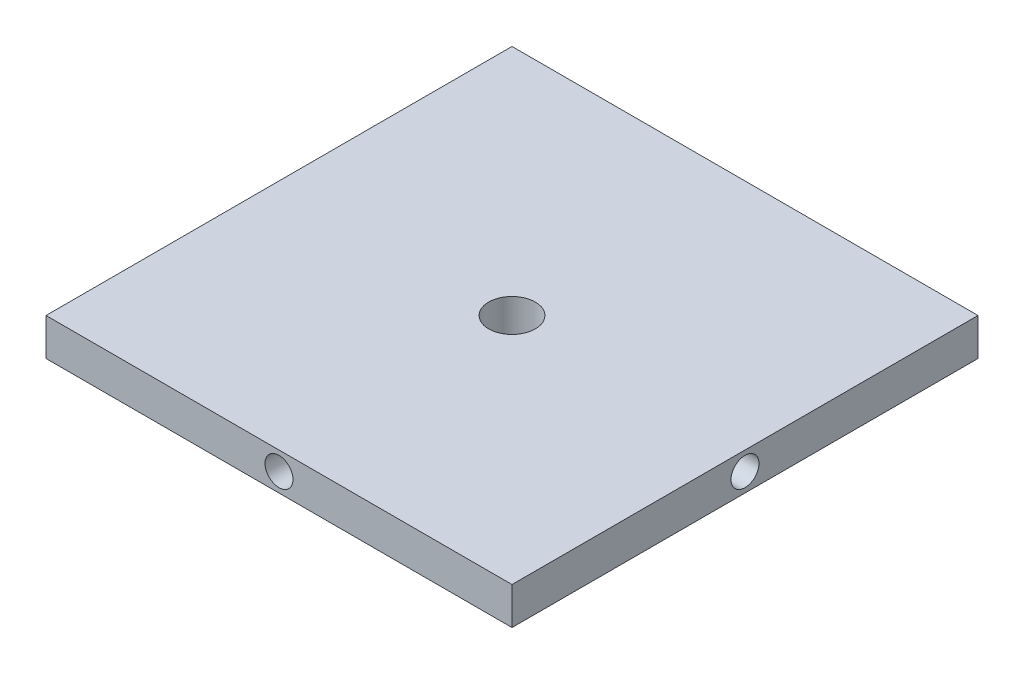
ISO-10303-21;
HEADER;
FILE_DESCRIPTION(('STEP AP214'),'2;1');
FILE_NAME('part.step','',(''),(''),'','','');
FILE_SCHEMA(('AUTOMOTIVE_DESIGN { 1 0 10303 214 1 1 1 1 }'));
ENDSEC;
DATA;
#1=APPLICATION_CONTEXT('core data for automotive mechanical design processes');
#2=APPLICATION_PROTOCOL_DEFINITION('international standard','automotive_design',2000,#1);
#3=PRODUCT_CONTEXT('',#1,'mechanical');
#4=PRODUCT('Part','Part','',(#3));
#5=PRODUCT_RELATED_PRODUCT_CATEGORY('part','',(#4));
#6=PRODUCT_DEFINITION_FORMATION('','',#4);
#7=PRODUCT_DEFINITION_CONTEXT('part definition',#1,'design');
#8=PRODUCT_DEFINITION('design','',#6,#7);
#9=PRODUCT_DEFINITION_SHAPE('','',#8);
#10=(LENGTH_UNIT() NAMED_UNIT(*) SI_UNIT(.MILLI.,.METRE.));
#11=(NAMED_UNIT(*) PLANE_ANGLE_UNIT() SI_UNIT($,.RADIAN.));
#12=(NAMED_UNIT(*) SI_UNIT($,.STERADIAN.) SOLID_ANGLE_UNIT());
#13=UNCERTAINTY_MEASURE_WITH_UNIT(LENGTH_MEASURE(1.E-05),#10,'distance_accuracy_value','');
#14=(GEOMETRIC_REPRESENTATION_CONTEXT(3) GLOBAL_UNCERTAINTY_ASSIGNED_CONTEXT((#13)) GLOBAL_UNIT_ASSIGNED_CONTEXT((#10,
#11,#12)) REPRESENTATION_CONTEXT('',''));
#15=CARTESIAN_POINT('',(0.,0.,0.));
#16=DIRECTION('',(0.,0.,1.));
#17=DIRECTION('',(1.,0.,0.));
#18=AXIS2_PLACEMENT_3D('',#15,#16,#17);
#19=CARTESIAN_POINT('',(0.,25.4,0.));
#20=DIRECTION('',(0.,-1.,0.));
#21=DIRECTION('',(0.,0.,-1.));
#22=AXIS2_PLACEMENT_3D('',#19,#20,#21);
#23=PLANE('',#22);
#24=DIRECTION('',(0.,0.,-1.));
#25=VECTOR('',#24,1.);
#26=CARTESIAN_POINT('',(158.75,25.4,158.75));
#27=LINE('',#26,#25);
#28=CARTESIAN_POINT('',(158.75,25.4,158.75));
#29=VERTEX_POINT('',#28);
#30=CARTESIAN_POINT('',(158.75,25.4,-158.75));
#31=VERTEX_POINT('',#30);
#32=EDGE_CURVE('E116',#29,#31,#27,.T.);
#33=ORIENTED_EDGE('',*,*,#32,.T.);
#34=DIRECTION('',(-1.,0.,0.));
#35=VECTOR('',#34,1.);
#36=CARTESIAN_POINT('',(-158.75,25.4,-158.75));
#37=LINE('',#36,#35);
#38=CARTESIAN_POINT('',(-158.75,25.4,-158.75));
#39=VERTEX_POINT('',#38);
#40=EDGE_CURVE('E81',#31,#39,#37,.T.);
#41=ORIENTED_EDGE('',*,*,#40,.T.);
#42=DIRECTION('',(0.,0.,1.));
#43=VECTOR('',#42,1.);
#44=CARTESIAN_POINT('',(-158.75,25.4,158.75));
#45=LINE('',#44,#43);
#46=CARTESIAN_POINT('',(-158.75,25.4,158.75));
#47=VERTEX_POINT('',#46);
#48=EDGE_CURVE('E119',#39,#47,#45,.T.);
#49=ORIENTED_EDGE('',*,*,#48,.T.);
#50=DIRECTION('',(1.,0.,0.));
#51=VECTOR('',#50,1.);
#52=CARTESIAN_POINT('',(-158.75,25.4,158.75));
#53=LINE('',#52,#51);
#54=EDGE_CURVE('E50',#47,#29,#53,.T.);
#55=ORIENTED_EDGE('',*,*,#54,.T.);
#56=EDGE_LOOP('',(#33,#41,#49,#55));
#57=FACE_BOUND('',#56,.T.);
#58=CARTESIAN_POINT('',(0.,25.4,0.));
#59=DIRECTION('',(0.,1.,0.));
#60=DIRECTION('',(0.,0.,1.));
#61=AXIS2_PLACEMENT_3D('',#58,#59,#60);
#62=CIRCLE('',#61,15.875);
#63=CARTESIAN_POINT('',(0.,25.4,15.875));
#64=VERTEX_POINT('',#63);
#65=EDGE_CURVE('E110',#64,#64,#62,.T.);
#66=ORIENTED_EDGE('',*,*,#65,.F.);
#67=EDGE_LOOP('',(#66));
#68=FACE_BOUND('',#67,.T.);
#69=ADVANCED_FACE('F33',(#57,#68),#23,.F.);
#70=CARTESIAN_POINT('',(0.,0.,0.));
#71=DIRECTION('',(0.,-1.,0.));
#72=DIRECTION('',(0.,0.,-1.));
#73=AXIS2_PLACEMENT_3D('',#70,#71,#72);
#74=PLANE('',#73);
#75=DIRECTION('',(0.,0.,-1.));
#76=VECTOR('',#75,1.);
#77=CARTESIAN_POINT('',(158.75,0.,158.75));
#78=LINE('',#77,#76);
#79=CARTESIAN_POINT('',(158.75,0.,158.75));
#80=VERTEX_POINT('',#79);
#81=CARTESIAN_POINT('',(158.75,0.,-158.75));
#82=VERTEX_POINT('',#81);
#83=EDGE_CURVE('E113',#80,#82,#78,.T.);
#84=ORIENTED_EDGE('',*,*,#83,.F.);
#85=DIRECTION('',(1.,0.,0.));
#86=VECTOR('',#85,1.);
#87=CARTESIAN_POINT('',(-158.75,0.,158.75));
#88=LINE('',#87,#86);
#89=CARTESIAN_POINT('',(-158.75,0.,158.75));
#90=VERTEX_POINT('',#89);
#91=EDGE_CURVE('E74',#90,#80,#88,.T.);
#92=ORIENTED_EDGE('',*,*,#91,.F.);
#93=DIRECTION('',(0.,0.,1.));
#94=VECTOR('',#93,1.);
#95=CARTESIAN_POINT('',(-158.75,0.,158.75));
#96=LINE('',#95,#94);
#97=CARTESIAN_POINT('',(-158.75,0.,-158.75));
#98=VERTEX_POINT('',#97);
#99=EDGE_CURVE('E68',#98,#90,#96,.T.);
#100=ORIENTED_EDGE('',*,*,#99,.F.);
#101=DIRECTION('',(-1.,0.,0.));
#102=VECTOR('',#101,1.);
#103=CARTESIAN_POINT('',(-158.75,0.,-158.75));
#104=LINE('',#103,#102);
#105=EDGE_CURVE('E125',#82,#98,#104,.T.);
#106=ORIENTED_EDGE('',*,*,#105,.F.);
#107=EDGE_LOOP('',(#84,#92,#100,#106));
#108=FACE_BOUND('',#107,.T.);
#109=CARTESIAN_POINT('',(0.,0.,0.));
#110=DIRECTION('',(0.,1.,0.));
#111=DIRECTION('',(0.,0.,1.));
#112=AXIS2_PLACEMENT_3D('',#109,#110,#111);
#113=CIRCLE('',#112,15.875);
#114=CARTESIAN_POINT('',(0.,0.,15.875));
#115=VERTEX_POINT('',#114);
#116=EDGE_CURVE('E109',#115,#115,#113,.T.);
#117=ORIENTED_EDGE('',*,*,#116,.T.);
#118=EDGE_LOOP('',(#117));
#119=FACE_BOUND('',#118,.T.);
#120=ADVANCED_FACE('F135',(#108,#119),#74,.T.);
#121=CARTESIAN_POINT('',(158.75,25.4,158.75));
#122=DIRECTION('',(-1.,0.,0.));
#123=DIRECTION('',(0.,0.,1.));
#124=AXIS2_PLACEMENT_3D('',#121,#122,#123);
#125=PLANE('',#124);
#126=CARTESIAN_POINT('',(158.75,12.7,0.));
#127=DIRECTION('',(1.,0.,0.));
#128=DIRECTION('',(0.,0.,-1.));
#129=AXIS2_PLACEMENT_3D('',#126,#127,#128);
#130=CIRCLE('',#129,9.52499999999999);
#131=CARTESIAN_POINT('',(158.75,12.7,-9.52499999999999));
#132=VERTEX_POINT('',#131);
#133=EDGE_CURVE('E98',#132,#132,#130,.T.);
#134=ORIENTED_EDGE('',*,*,#133,.F.);
#135=EDGE_LOOP('',(#134));
#136=FACE_BOUND('',#135,.T.);
#137=ORIENTED_EDGE('',*,*,#83,.T.);
#138=DIRECTION('',(0.,-1.,0.));
#139=VECTOR('',#138,1.);
#140=CARTESIAN_POINT('',(158.75,25.4,-158.75));
#141=LINE('',#140,#139);
#142=EDGE_CURVE('E11',#31,#82,#141,.T.);
#143=ORIENTED_EDGE('',*,*,#142,.F.);
#144=ORIENTED_EDGE('',*,*,#32,.F.);
#145=DIRECTION('',(0.,-1.,0.));
#146=VECTOR('',#145,1.);
#147=CARTESIAN_POINT('',(158.75,25.4,158.75));
#148=LINE('',#147,#146);
#149=EDGE_CURVE('E122',#29,#80,#148,.T.);
#150=ORIENTED_EDGE('',*,*,#149,.T.);
#151=EDGE_LOOP('',(#137,#143,#144,#150));
#152=FACE_BOUND('',#151,.T.);
#153=ADVANCED_FACE('F35',(#136,#152),#125,.F.);
#154=CARTESIAN_POINT('',(-158.75,25.4,-158.75));
#155=DIRECTION('',(0.,0.,1.));
#156=DIRECTION('',(1.,0.,0.));
#157=AXIS2_PLACEMENT_3D('',#154,#155,#156);
#158=PLANE('',#157);
#159=ORIENTED_EDGE('',*,*,#105,.T.);
#160=DIRECTION('',(0.,-1.,0.));
#161=VECTOR('',#160,1.);
#162=CARTESIAN_POINT('',(-158.75,25.4,-158.75));
#163=LINE('',#162,#161);
#164=EDGE_CURVE('E42',#39,#98,#163,.T.);
#165=ORIENTED_EDGE('',*,*,#164,.F.);
#166=ORIENTED_EDGE('',*,*,#40,.F.);
#167=ORIENTED_EDGE('',*,*,#142,.T.);
#168=EDGE_LOOP('',(#159,#165,#166,#167));
#169=FACE_BOUND('',#168,.T.);
#170=ADVANCED_FACE('F152',(#169),#158,.F.);
#171=CARTESIAN_POINT('',(-158.75,25.4,158.75));
#172=DIRECTION('',(1.,0.,0.));
#173=DIRECTION('',(0.,0.,-1.));
#174=AXIS2_PLACEMENT_3D('',#171,#172,#173);
#175=PLANE('',#174);
#176=ORIENTED_EDGE('',*,*,#99,.T.);
#177=DIRECTION('',(0.,-1.,0.));
#178=VECTOR('',#177,1.);
#179=CARTESIAN_POINT('',(-158.75,25.4,158.75));
#180=LINE('',#179,#178);
#181=EDGE_CURVE('E130',#47,#90,#180,.T.);
#182=ORIENTED_EDGE('',*,*,#181,.F.);
#183=ORIENTED_EDGE('',*,*,#48,.F.);
#184=ORIENTED_EDGE('',*,*,#164,.T.);
#185=EDGE_LOOP('',(#176,#182,#183,#184));
#186=FACE_BOUND('',#185,.T.);
#187=ADVANCED_FACE('F132',(#186),#175,.F.);
#188=CARTESIAN_POINT('',(-158.75,25.4,158.75));
#189=DIRECTION('',(0.,0.,-1.));
#190=DIRECTION('',(-1.,0.,0.));
#191=AXIS2_PLACEMENT_3D('',#188,#189,#190);
#192=PLANE('',#191);
#193=CARTESIAN_POINT('',(0.,12.7,158.75));
#194=DIRECTION('',(0.,0.,1.));
#195=DIRECTION('',(1.,0.,0.));
#196=AXIS2_PLACEMENT_3D('',#193,#194,#195);
#197=CIRCLE('',#196,9.52499999999998);
#198=CARTESIAN_POINT('',(9.52499999999998,12.7,158.75));
#199=VERTEX_POINT('',#198);
#200=EDGE_CURVE('E99',#199,#199,#197,.T.);
#201=ORIENTED_EDGE('',*,*,#200,.F.);
#202=EDGE_LOOP('',(#201));
#203=FACE_BOUND('',#202,.T.);
#204=ORIENTED_EDGE('',*,*,#91,.T.);
#205=ORIENTED_EDGE('',*,*,#149,.F.);
#206=ORIENTED_EDGE('',*,*,#54,.F.);
#207=ORIENTED_EDGE('',*,*,#181,.T.);
#208=EDGE_LOOP('',(#204,#205,#206,#207));
#209=FACE_BOUND('',#208,.T.);
#210=ADVANCED_FACE('F140',(#203,#209),#192,.F.);
#211=CARTESIAN_POINT('',(0.,25.4,0.));
#212=DIRECTION('',(0.,-1.,0.));
#213=DIRECTION('',(0.,0.,-1.));
#214=AXIS2_PLACEMENT_3D('',#211,#212,#213);
#215=CYLINDRICAL_SURFACE('',#214,15.875);
#216=ORIENTED_EDGE('',*,*,#65,.T.);
#217=EDGE_LOOP('',(#216));
#218=FACE_BOUND('',#217,.T.);
#219=ORIENTED_EDGE('',*,*,#116,.F.);
#220=EDGE_LOOP('',(#219));
#221=FACE_BOUND('',#220,.T.);
#222=ADVANCED_FACE('F142',(#218,#221),#215,.F.);
#223=CARTESIAN_POINT('',(82.55,12.7,0.));
#224=DIRECTION('',(1.,0.,0.));
#225=DIRECTION('',(0.,0.,-1.));
#226=AXIS2_PLACEMENT_3D('',#223,#224,#225);
#227=CONICAL_SURFACE('',#226,9.52499999999997,1.02974425867665);
#228=CARTESIAN_POINT('',(76.8268026037624,12.7,0.));
#229=VERTEX_POINT('',#228);
#230=VERTEX_LOOP('',#229);
#231=FACE_BOUND('',#230,.T.);
#232=CARTESIAN_POINT('',(82.55,12.7,0.));
#233=DIRECTION('',(1.,0.,0.));
#234=DIRECTION('',(0.,0.,-1.));
#235=AXIS2_PLACEMENT_3D('',#232,#233,#234);
#236=CIRCLE('',#235,9.52499999999997);
#237=CARTESIAN_POINT('',(82.55,12.7,-9.52499999999997));
#238=VERTEX_POINT('',#237);
#239=EDGE_CURVE('E102',#238,#238,#236,.T.);
#240=ORIENTED_EDGE('',*,*,#239,.T.);
#241=EDGE_LOOP('',(#240));
#242=FACE_BOUND('',#241,.T.);
#243=ADVANCED_FACE('F149',(#231,#242),#227,.F.);
#244=CARTESIAN_POINT('',(158.75,12.7,0.));
#245=DIRECTION('',(1.,0.,0.));
#246=DIRECTION('',(0.,0.,-1.));
#247=AXIS2_PLACEMENT_3D('',#244,#245,#246);
#248=CYLINDRICAL_SURFACE('',#247,9.52499999999998);
#249=ORIENTED_EDGE('',*,*,#239,.F.);
#250=EDGE_LOOP('',(#249));
#251=FACE_BOUND('',#250,.T.);
#252=ORIENTED_EDGE('',*,*,#133,.T.);
#253=EDGE_LOOP('',(#252));
#254=FACE_BOUND('',#253,.T.);
#255=ADVANCED_FACE('F92',(#251,#254),#248,.F.);
#256=CARTESIAN_POINT('',(0.,12.7,82.55));
#257=DIRECTION('',(0.,0.,1.));
#258=DIRECTION('',(1.,0.,0.));
#259=AXIS2_PLACEMENT_3D('',#256,#257,#258);
#260=CONICAL_SURFACE('',#259,9.52499999999997,1.02974425867665);
#261=CARTESIAN_POINT('',(0.,12.7,76.8268026037625));
#262=VERTEX_POINT('',#261);
#263=VERTEX_LOOP('',#262);
#264=FACE_BOUND('',#263,.T.);
#265=CARTESIAN_POINT('',(0.,12.7,82.55));
#266=DIRECTION('',(0.,0.,1.));
#267=DIRECTION('',(1.,0.,0.));
#268=AXIS2_PLACEMENT_3D('',#265,#266,#267);
#269=CIRCLE('',#268,9.52499999999997);
#270=CARTESIAN_POINT('',(9.52499999999997,12.7,82.55));
#271=VERTEX_POINT('',#270);
#272=EDGE_CURVE('E96',#271,#271,#269,.T.);
#273=ORIENTED_EDGE('',*,*,#272,.T.);
#274=EDGE_LOOP('',(#273));
#275=FACE_BOUND('',#274,.T.);
#276=ADVANCED_FACE('F88',(#264,#275),#260,.F.);
#277=CARTESIAN_POINT('',(0.,12.7,158.75));
#278=DIRECTION('',(0.,0.,1.));
#279=DIRECTION('',(1.,0.,0.));
#280=AXIS2_PLACEMENT_3D('',#277,#278,#279);
#281=CYLINDRICAL_SURFACE('',#280,9.52499999999997);
#282=ORIENTED_EDGE('',*,*,#272,.F.);
#283=EDGE_LOOP('',(#282));
#284=FACE_BOUND('',#283,.T.);
#285=ORIENTED_EDGE('',*,*,#200,.T.);
#286=EDGE_LOOP('',(#285));
#287=FACE_BOUND('',#286,.T.);
#288=ADVANCED_FACE('F91',(#284,#287),#281,.F.);
#289=CLOSED_SHELL('',(#69,#120,#153,#170,#187,#210,#222,#243,#255,#276,#288));
#290=MANIFOLD_SOLID_BREP('B2',#289);
#291=ADVANCED_BREP_SHAPE_REPRESENTATION('',(#18,#290),#14);
#292=SHAPE_DEFINITION_REPRESENTATION(#9,#291);
ENDSEC;
END-ISO-10303-21;
